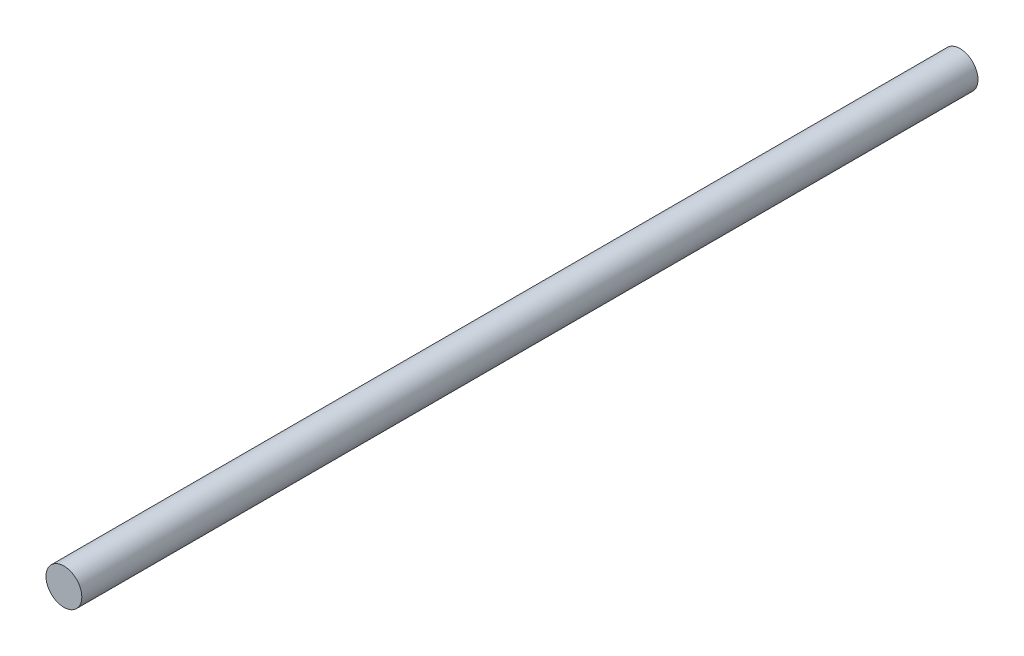
ISO-10303-21;
HEADER;
FILE_DESCRIPTION(('STEP AP214'),'2;1');
FILE_NAME('part.step','',(''),(''),'','','');
FILE_SCHEMA(('AUTOMOTIVE_DESIGN { 1 0 10303 214 1 1 1 1 }'));
ENDSEC;
DATA;
#1=APPLICATION_CONTEXT('core data for automotive mechanical design processes');
#2=APPLICATION_PROTOCOL_DEFINITION('international standard','automotive_design',2000,#1);
#3=PRODUCT_CONTEXT('',#1,'mechanical');
#4=PRODUCT('Part','Part','',(#3));
#5=PRODUCT_RELATED_PRODUCT_CATEGORY('part','',(#4));
#6=PRODUCT_DEFINITION_FORMATION('','',#4);
#7=PRODUCT_DEFINITION_CONTEXT('part definition',#1,'design');
#8=PRODUCT_DEFINITION('design','',#6,#7);
#9=PRODUCT_DEFINITION_SHAPE('','',#8);
#10=(LENGTH_UNIT() NAMED_UNIT(*) SI_UNIT(.MILLI.,.METRE.));
#11=(NAMED_UNIT(*) PLANE_ANGLE_UNIT() SI_UNIT($,.RADIAN.));
#12=(NAMED_UNIT(*) SI_UNIT($,.STERADIAN.) SOLID_ANGLE_UNIT());
#13=UNCERTAINTY_MEASURE_WITH_UNIT(LENGTH_MEASURE(1.E-05),#10,'distance_accuracy_value','');
#14=(GEOMETRIC_REPRESENTATION_CONTEXT(3) GLOBAL_UNCERTAINTY_ASSIGNED_CONTEXT((#13)) GLOBAL_UNIT_ASSIGNED_CONTEXT((#10,
#11,#12)) REPRESENTATION_CONTEXT('',''));
#15=CARTESIAN_POINT('',(0.,0.,0.));
#16=DIRECTION('',(0.,0.,1.));
#17=DIRECTION('',(1.,0.,0.));
#18=AXIS2_PLACEMENT_3D('',#15,#16,#17);
#19=CARTESIAN_POINT('',(0.,0.,200.));
#20=DIRECTION('',(0.,0.,-1.));
#21=DIRECTION('',(-1.,0.,0.));
#22=AXIS2_PLACEMENT_3D('',#19,#20,#21);
#23=CYLINDRICAL_SURFACE('',#22,4.);
#24=CARTESIAN_POINT('',(0.,0.,200.));
#25=DIRECTION('',(0.,0.,1.));
#26=DIRECTION('',(1.,0.,0.));
#27=AXIS2_PLACEMENT_3D('',#24,#25,#26);
#28=CIRCLE('',#27,4.);
#29=CARTESIAN_POINT('',(4.,0.,200.));
#30=VERTEX_POINT('',#29);
#31=EDGE_CURVE('E10',#30,#30,#28,.T.);
#32=ORIENTED_EDGE('',*,*,#31,.F.);
#33=EDGE_LOOP('',(#32));
#34=FACE_BOUND('',#33,.T.);
#35=CARTESIAN_POINT('',(0.,0.,0.));
#36=DIRECTION('',(0.,0.,1.));
#37=DIRECTION('',(1.,0.,0.));
#38=AXIS2_PLACEMENT_3D('',#35,#36,#37);
#39=CIRCLE('',#38,4.);
#40=CARTESIAN_POINT('',(4.,0.,0.));
#41=VERTEX_POINT('',#40);
#42=EDGE_CURVE('E32',#41,#41,#39,.T.);
#43=ORIENTED_EDGE('',*,*,#42,.T.);
#44=EDGE_LOOP('',(#43));
#45=FACE_BOUND('',#44,.T.);
#46=ADVANCED_FACE('F29',(#34,#45),#23,.T.);
#47=CARTESIAN_POINT('',(0.,0.,200.));
#48=DIRECTION('',(0.,0.,1.));
#49=DIRECTION('',(1.,0.,0.));
#50=AXIS2_PLACEMENT_3D('',#47,#48,#49);
#51=PLANE('',#50);
#52=ORIENTED_EDGE('',*,*,#31,.T.);
#53=EDGE_LOOP('',(#52));
#54=FACE_BOUND('',#53,.T.);
#55=ADVANCED_FACE('F44',(#54),#51,.T.);
#56=CARTESIAN_POINT('',(0.,0.,0.));
#57=DIRECTION('',(0.,0.,1.));
#58=DIRECTION('',(1.,0.,0.));
#59=AXIS2_PLACEMENT_3D('',#56,#57,#58);
#60=PLANE('',#59);
#61=ORIENTED_EDGE('',*,*,#42,.F.);
#62=EDGE_LOOP('',(#61));
#63=FACE_BOUND('',#62,.T.);
#64=ADVANCED_FACE('F42',(#63),#60,.F.);
#65=CLOSED_SHELL('',(#46,#55,#64));
#66=MANIFOLD_SOLID_BREP('B2',#65);
#67=ADVANCED_BREP_SHAPE_REPRESENTATION('',(#18,#66),#14);
#68=SHAPE_DEFINITION_REPRESENTATION(#9,#67);
ENDSEC;
END-ISO-10303-21;
